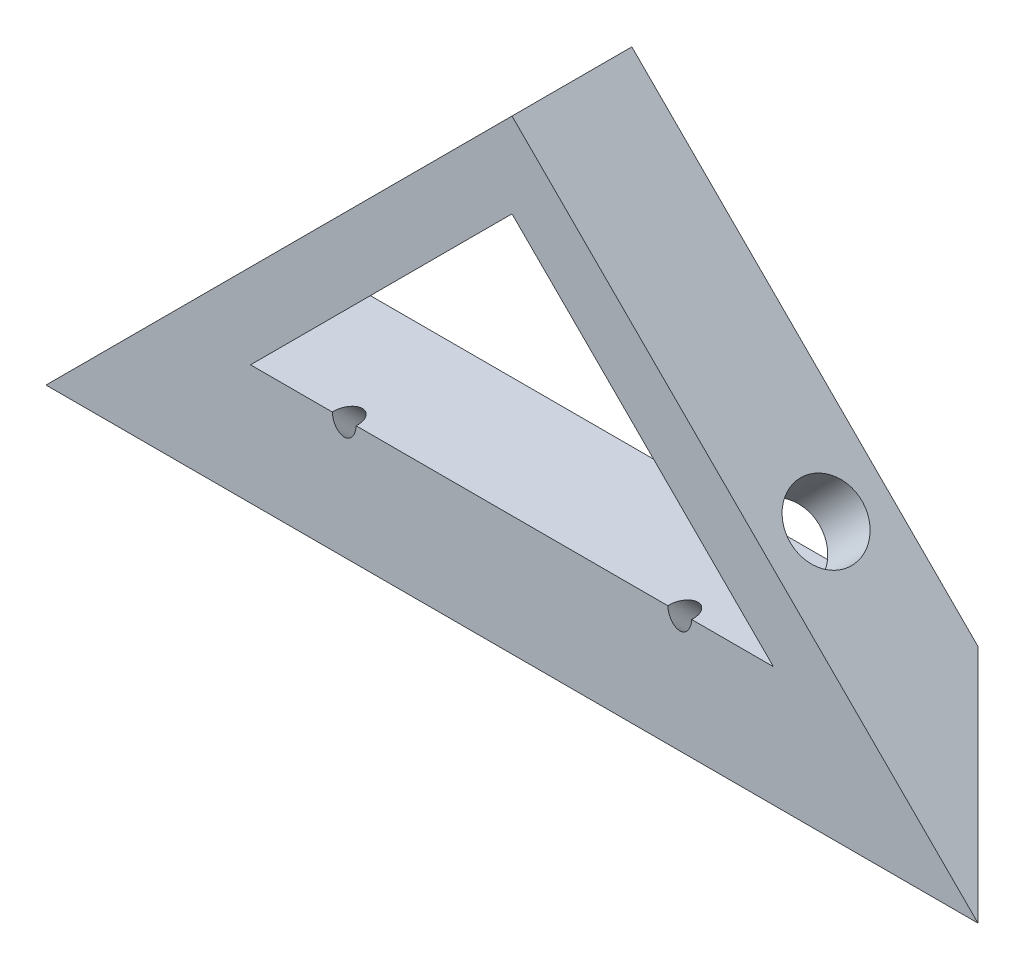
ISO-10303-21;
HEADER;
FILE_DESCRIPTION(('STEP AP214'),'2;1');
FILE_NAME('part.step','',(''),(''),'','','');
FILE_SCHEMA(('AUTOMOTIVE_DESIGN { 1 0 10303 214 1 1 1 1 }'));
ENDSEC;
DATA;
#1=APPLICATION_CONTEXT('core data for automotive mechanical design processes');
#2=APPLICATION_PROTOCOL_DEFINITION('international standard','automotive_design',2000,#1);
#3=PRODUCT_CONTEXT('',#1,'mechanical');
#4=PRODUCT('Part','Part','',(#3));
#5=PRODUCT_RELATED_PRODUCT_CATEGORY('part','',(#4));
#6=PRODUCT_DEFINITION_FORMATION('','',#4);
#7=PRODUCT_DEFINITION_CONTEXT('part definition',#1,'design');
#8=PRODUCT_DEFINITION('design','',#6,#7);
#9=PRODUCT_DEFINITION_SHAPE('','',#8);
#10=(LENGTH_UNIT() NAMED_UNIT(*) SI_UNIT(.MILLI.,.METRE.));
#11=(NAMED_UNIT(*) PLANE_ANGLE_UNIT() SI_UNIT($,.RADIAN.));
#12=(NAMED_UNIT(*) SI_UNIT($,.STERADIAN.) SOLID_ANGLE_UNIT());
#13=UNCERTAINTY_MEASURE_WITH_UNIT(LENGTH_MEASURE(1.E-05),#10,'distance_accuracy_value','');
#14=(GEOMETRIC_REPRESENTATION_CONTEXT(3) GLOBAL_UNCERTAINTY_ASSIGNED_CONTEXT((#13)) GLOBAL_UNIT_ASSIGNED_CONTEXT((#10,
#11,#12)) REPRESENTATION_CONTEXT('',''));
#15=CARTESIAN_POINT('',(0.,0.,0.));
#16=DIRECTION('',(0.,0.,1.));
#17=DIRECTION('',(1.,0.,0.));
#18=AXIS2_PLACEMENT_3D('',#15,#16,#17);
#19=CARTESIAN_POINT('',(14.4454364826299,14.4454364826297,10.));
#20=DIRECTION('',(-0.707106781186554,-0.707106781186541,0.));
#21=DIRECTION('',(0.707106781186541,-0.707106781186554,0.));
#22=AXIS2_PLACEMENT_3D('',#19,#20,#21);
#23=PLANE('',#22);
#24=CARTESIAN_POINT('',(21.2132034355962,7.67766952966327,5.));
#25=DIRECTION('',(0.707106781186554,0.707106781186541,0.));
#26=DIRECTION('',(-0.707106781186541,0.707106781186554,0.));
#27=AXIS2_PLACEMENT_3D('',#24,#25,#26);
#28=CIRCLE('',#27,3.);
#29=CARTESIAN_POINT('',(19.0918830920366,9.79898987322294,5.));
#30=VERTEX_POINT('',#29);
#31=EDGE_CURVE('E295',#30,#30,#28,.T.);
#32=ORIENTED_EDGE('',*,*,#31,.F.);
#33=EDGE_LOOP('',(#32));
#34=FACE_BOUND('',#33,.T.);
#35=DIRECTION('',(-0.707106781186541,0.707106781186554,0.));
#36=VECTOR('',#35,1.);
#37=CARTESIAN_POINT('',(14.4454364826299,14.4454364826297,10.));
#38=LINE('',#37,#36);
#39=CARTESIAN_POINT('',(38.8908729652592,-10.,10.));
#40=VERTEX_POINT('',#39);
#41=CARTESIAN_POINT('',(0.,28.8908729652599,10.));
#42=VERTEX_POINT('',#41);
#43=EDGE_CURVE('E127',#40,#42,#38,.T.);
#44=ORIENTED_EDGE('',*,*,#43,.F.);
#45=DIRECTION('',(-0.577350269189617,0.577350269189627,-0.577350269189633));
#46=VECTOR('',#45,1.);
#47=CARTESIAN_POINT('',(22.5939153101732,6.29695765508624,-6.29695765508641));
#48=LINE('',#47,#46);
#49=CARTESIAN_POINT('',(28.8908729652594,-1.05818132034585E-13,0.));
#50=VERTEX_POINT('',#49);
#51=EDGE_CURVE('E137',#40,#50,#48,.T.);
#52=ORIENTED_EDGE('',*,*,#51,.T.);
#53=DIRECTION('',(-0.707106781186541,0.707106781186554,0.));
#54=VECTOR('',#53,1.);
#55=CARTESIAN_POINT('',(14.4454364826299,14.4454364826297,0.));
#56=LINE('',#55,#54);
#57=CARTESIAN_POINT('',(0.,28.8908729652599,0.));
#58=VERTEX_POINT('',#57);
#59=EDGE_CURVE('E142',#50,#58,#56,.T.);
#60=ORIENTED_EDGE('',*,*,#59,.T.);
#61=DIRECTION('',(0.,0.,-1.));
#62=VECTOR('',#61,1.);
#63=CARTESIAN_POINT('',(0.,28.8908729652599,10.));
#64=LINE('',#63,#62);
#65=EDGE_CURVE('E147',#42,#58,#64,.T.);
#66=ORIENTED_EDGE('',*,*,#65,.F.);
#67=EDGE_LOOP('',(#44,#52,#60,#66));
#68=FACE_BOUND('',#67,.T.);
#69=ADVANCED_FACE('F33',(#34,#68),#23,.F.);
#70=CARTESIAN_POINT('',(10.9099025766972,10.909902576697,10.));
#71=DIRECTION('',(-0.707106781186554,-0.707106781186541,0.));
#72=DIRECTION('',(0.707106781186541,-0.707106781186554,0.));
#73=AXIS2_PLACEMENT_3D('',#70,#71,#72);
#74=PLANE('',#73);
#75=CARTESIAN_POINT('',(17.6776695296635,4.14213562373058,5.));
#76=DIRECTION('',(-0.707106781186554,-0.707106781186541,0.));
#77=DIRECTION('',(0.707106781186541,-0.707106781186554,0.));
#78=AXIS2_PLACEMENT_3D('',#75,#76,#77);
#79=CIRCLE('',#78,3.);
#80=CARTESIAN_POINT('',(19.7989898732231,2.02081528017091,5.));
#81=VERTEX_POINT('',#80);
#82=EDGE_CURVE('E109',#81,#81,#79,.F.);
#83=ORIENTED_EDGE('',*,*,#82,.T.);
#84=EDGE_LOOP('',(#83));
#85=FACE_BOUND('',#84,.T.);
#86=DIRECTION('',(-0.707106781186541,0.707106781186554,0.));
#87=VECTOR('',#86,1.);
#88=CARTESIAN_POINT('',(10.9099025766972,10.909902576697,0.));
#89=LINE('',#88,#87);
#90=CARTESIAN_POINT('',(21.819805153394,-1.05818132034585E-13,0.));
#91=VERTEX_POINT('',#90);
#92=CARTESIAN_POINT('',(0.,21.8198051533944,0.));
#93=VERTEX_POINT('',#92);
#94=EDGE_CURVE('E133',#91,#93,#89,.T.);
#95=ORIENTED_EDGE('',*,*,#94,.F.);
#96=DIRECTION('',(0.,0.,-1.));
#97=VECTOR('',#96,1.);
#98=CARTESIAN_POINT('',(21.8198051533939,0.,10.));
#99=LINE('',#98,#97);
#100=CARTESIAN_POINT('',(21.8198051533939,0.,10.));
#101=VERTEX_POINT('',#100);
#102=EDGE_CURVE('E150',#101,#91,#99,.T.);
#103=ORIENTED_EDGE('',*,*,#102,.F.);
#104=DIRECTION('',(-0.707106781186541,0.707106781186554,0.));
#105=VECTOR('',#104,1.);
#106=CARTESIAN_POINT('',(10.9099025766972,10.909902576697,10.));
#107=LINE('',#106,#105);
#108=CARTESIAN_POINT('',(0.,21.8198051533944,10.));
#109=VERTEX_POINT('',#108);
#110=EDGE_CURVE('E118',#101,#109,#107,.T.);
#111=ORIENTED_EDGE('',*,*,#110,.T.);
#112=DIRECTION('',(0.,0.,-1.));
#113=VECTOR('',#112,1.);
#114=CARTESIAN_POINT('',(0.,21.8198051533944,10.));
#115=LINE('',#114,#113);
#116=EDGE_CURVE('E132',#109,#93,#115,.T.);
#117=ORIENTED_EDGE('',*,*,#116,.T.);
#118=EDGE_LOOP('',(#95,#103,#111,#117));
#119=FACE_BOUND('',#118,.T.);
#120=ADVANCED_FACE('F35',(#85,#119),#74,.T.);
#121=CARTESIAN_POINT('',(0.,0.,10.));
#122=DIRECTION('',(0.,1.,0.));
#123=DIRECTION('',(-1.,0.,0.));
#124=AXIS2_PLACEMENT_3D('',#121,#122,#123);
#125=PLANE('',#124);
#126=CARTESIAN_POINT('',(-14.,0.,9.89949493661161));
#127=DIRECTION('',(0.,1.,0.));
#128=DIRECTION('',(0.,0.,-1.));
#129=AXIS2_PLACEMENT_3D('',#126,#127,#128);
#130=ELLIPSE('',#129,1.41421356237309,1.);
#131=CARTESIAN_POINT('',(-14.9974714863677,0.,10.));
#132=VERTEX_POINT('',#131);
#133=CARTESIAN_POINT('',(-13.0025285136323,0.,10.));
#134=VERTEX_POINT('',#133);
#135=EDGE_CURVE('E54',#132,#134,#130,.F.);
#136=ORIENTED_EDGE('',*,*,#135,.T.);
#137=DIRECTION('',(1.,0.,0.));
#138=VECTOR('',#137,1.);
#139=CARTESIAN_POINT('',(0.,0.,10.));
#140=LINE('',#139,#138);
#141=CARTESIAN_POINT('',(13.0025285136323,0.,10.));
#142=VERTEX_POINT('',#141);
#143=EDGE_CURVE('E107',#134,#142,#140,.T.);
#144=ORIENTED_EDGE('',*,*,#143,.T.);
#145=CARTESIAN_POINT('',(14.,0.,9.89949493661163));
#146=DIRECTION('',(0.,1.,0.));
#147=DIRECTION('',(0.,0.,-1.));
#148=AXIS2_PLACEMENT_3D('',#145,#146,#147);
#149=ELLIPSE('',#148,1.41421356237309,1.);
#150=CARTESIAN_POINT('',(14.9974714863677,0.,10.));
#151=VERTEX_POINT('',#150);
#152=EDGE_CURVE('E47',#142,#151,#149,.F.);
#153=ORIENTED_EDGE('',*,*,#152,.T.);
#154=EDGE_CURVE('E115',#151,#101,#140,.T.);
#155=ORIENTED_EDGE('',*,*,#154,.T.);
#156=ORIENTED_EDGE('',*,*,#102,.T.);
#157=DIRECTION('',(1.,0.,0.));
#158=VECTOR('',#157,1.);
#159=CARTESIAN_POINT('',(0.,0.,0.));
#160=LINE('',#159,#158);
#161=CARTESIAN_POINT('',(-21.8198051533947,-1.05818132034585E-13,0.));
#162=VERTEX_POINT('',#161);
#163=EDGE_CURVE('E136',#162,#91,#160,.T.);
#164=ORIENTED_EDGE('',*,*,#163,.F.);
#165=DIRECTION('',(0.,0.,-1.));
#166=VECTOR('',#165,1.);
#167=CARTESIAN_POINT('',(-21.8198051533947,0.,10.));
#168=LINE('',#167,#166);
#169=CARTESIAN_POINT('',(-21.8198051533947,0.,10.));
#170=VERTEX_POINT('',#169);
#171=EDGE_CURVE('E152',#170,#162,#168,.T.);
#172=ORIENTED_EDGE('',*,*,#171,.F.);
#173=EDGE_CURVE('E108',#170,#132,#140,.T.);
#174=ORIENTED_EDGE('',*,*,#173,.T.);
#175=EDGE_LOOP('',(#136,#144,#153,#155,#156,#164,#172,#174));
#176=FACE_BOUND('',#175,.T.);
#177=ADVANCED_FACE('F106',(#176),#125,.T.);
#178=CARTESIAN_POINT('',(-10.9099025766972,10.9099025766973,10.));
#179=DIRECTION('',(0.707106781186544,-0.707106781186551,0.));
#180=DIRECTION('',(0.707106781186551,0.707106781186544,0.));
#181=AXIS2_PLACEMENT_3D('',#178,#179,#180);
#182=PLANE('',#181);
#183=CARTESIAN_POINT('',(-17.6776695296638,4.14213562373082,5.));
#184=DIRECTION('',(0.707106781186544,-0.707106781186551,0.));
#185=DIRECTION('',(0.707106781186551,0.707106781186544,0.));
#186=AXIS2_PLACEMENT_3D('',#183,#184,#185);
#187=CIRCLE('',#186,3.);
#188=CARTESIAN_POINT('',(-15.5563491861042,6.26345596729045,5.));
#189=VERTEX_POINT('',#188);
#190=EDGE_CURVE('E298',#189,#189,#187,.F.);
#191=ORIENTED_EDGE('',*,*,#190,.T.);
#192=EDGE_LOOP('',(#191));
#193=FACE_BOUND('',#192,.T.);
#194=DIRECTION('',(-0.707106781186551,-0.707106781186544,0.));
#195=VECTOR('',#194,1.);
#196=CARTESIAN_POINT('',(-10.9099025766972,10.9099025766973,0.));
#197=LINE('',#196,#195);
#198=EDGE_CURVE('E139',#93,#162,#197,.T.);
#199=ORIENTED_EDGE('',*,*,#198,.F.);
#200=ORIENTED_EDGE('',*,*,#116,.F.);
#201=DIRECTION('',(-0.707106781186551,-0.707106781186544,0.));
#202=VECTOR('',#201,1.);
#203=CARTESIAN_POINT('',(-10.9099025766972,10.9099025766973,10.));
#204=LINE('',#203,#202);
#205=EDGE_CURVE('E117',#109,#170,#204,.T.);
#206=ORIENTED_EDGE('',*,*,#205,.T.);
#207=ORIENTED_EDGE('',*,*,#171,.T.);
#208=EDGE_LOOP('',(#199,#200,#206,#207));
#209=FACE_BOUND('',#208,.T.);
#210=ADVANCED_FACE('F167',(#193,#209),#182,.T.);
#211=CARTESIAN_POINT('',(-14.4454364826299,14.4454364826301,10.));
#212=DIRECTION('',(0.707106781186544,-0.707106781186551,0.));
#213=DIRECTION('',(0.707106781186551,0.707106781186544,0.));
#214=AXIS2_PLACEMENT_3D('',#211,#212,#213);
#215=PLANE('',#214);
#216=CARTESIAN_POINT('',(-21.2132034355966,7.67766952966359,5.));
#217=DIRECTION('',(-0.707106781186544,0.707106781186551,0.));
#218=DIRECTION('',(-0.707106781186551,-0.707106781186544,0.));
#219=AXIS2_PLACEMENT_3D('',#216,#217,#218);
#220=CIRCLE('',#219,3.);
#221=CARTESIAN_POINT('',(-23.3345237791562,5.55634918610396,5.));
#222=VERTEX_POINT('',#221);
#223=EDGE_CURVE('E300',#222,#222,#220,.T.);
#224=ORIENTED_EDGE('',*,*,#223,.F.);
#225=EDGE_LOOP('',(#224));
#226=FACE_BOUND('',#225,.T.);
#227=DIRECTION('',(-0.707106781186551,-0.707106781186544,0.));
#228=VECTOR('',#227,1.);
#229=CARTESIAN_POINT('',(-14.4454364826299,14.4454364826301,0.));
#230=LINE('',#229,#228);
#231=CARTESIAN_POINT('',(-28.8908729652602,0.,0.));
#232=VERTEX_POINT('',#231);
#233=EDGE_CURVE('E144',#58,#232,#230,.T.);
#234=ORIENTED_EDGE('',*,*,#233,.T.);
#235=DIRECTION('',(-0.577350269189628,-0.577350269189622,0.577350269189628));
#236=VECTOR('',#235,1.);
#237=CARTESIAN_POINT('',(-22.5939153101735,6.29695765508669,-6.29695765508685));
#238=LINE('',#237,#236);
#239=CARTESIAN_POINT('',(-38.8908729652603,-10.,10.));
#240=VERTEX_POINT('',#239);
#241=EDGE_CURVE('E303',#232,#240,#238,.T.);
#242=ORIENTED_EDGE('',*,*,#241,.T.);
#243=DIRECTION('',(-0.707106781186551,-0.707106781186544,0.));
#244=VECTOR('',#243,1.);
#245=CARTESIAN_POINT('',(-14.4454364826299,14.4454364826301,10.));
#246=LINE('',#245,#244);
#247=EDGE_CURVE('E129',#42,#240,#246,.T.);
#248=ORIENTED_EDGE('',*,*,#247,.F.);
#249=ORIENTED_EDGE('',*,*,#65,.T.);
#250=EDGE_LOOP('',(#234,#242,#248,#249));
#251=FACE_BOUND('',#250,.T.);
#252=ADVANCED_FACE('F170',(#226,#251),#215,.F.);
#253=CARTESIAN_POINT('',(0.,0.,10.));
#254=DIRECTION('',(0.,0.,1.));
#255=DIRECTION('',(1.,0.,0.));
#256=AXIS2_PLACEMENT_3D('',#253,#254,#255);
#257=PLANE('',#256);
#258=CARTESIAN_POINT('',(-14.,0.100505063388384,10.));
#259=DIRECTION('',(0.,0.,1.));
#260=DIRECTION('',(0.,-1.,0.));
#261=AXIS2_PLACEMENT_3D('',#258,#259,#260);
#262=ELLIPSE('',#261,1.4142135623731,1.);
#263=EDGE_CURVE('E95',#134,#132,#262,.F.);
#264=ORIENTED_EDGE('',*,*,#263,.T.);
#265=ORIENTED_EDGE('',*,*,#173,.F.);
#266=ORIENTED_EDGE('',*,*,#205,.F.);
#267=ORIENTED_EDGE('',*,*,#110,.F.);
#268=ORIENTED_EDGE('',*,*,#154,.F.);
#269=CARTESIAN_POINT('',(14.,0.100505063388384,10.));
#270=DIRECTION('',(0.,0.,1.));
#271=DIRECTION('',(0.,-1.,0.));
#272=AXIS2_PLACEMENT_3D('',#269,#270,#271);
#273=ELLIPSE('',#272,1.4142135623731,1.);
#274=EDGE_CURVE('E114',#151,#142,#273,.F.);
#275=ORIENTED_EDGE('',*,*,#274,.T.);
#276=ORIENTED_EDGE('',*,*,#143,.F.);
#277=EDGE_LOOP('',(#264,#265,#266,#267,#268,#275,#276));
#278=FACE_BOUND('',#277,.T.);
#279=DIRECTION('',(1.,0.,0.));
#280=VECTOR('',#279,1.);
#281=CARTESIAN_POINT('',(0.,-10.,10.));
#282=LINE('',#281,#280);
#283=EDGE_CURVE('E124',#240,#40,#282,.T.);
#284=ORIENTED_EDGE('',*,*,#283,.T.);
#285=ORIENTED_EDGE('',*,*,#43,.T.);
#286=ORIENTED_EDGE('',*,*,#247,.T.);
#287=EDGE_LOOP('',(#284,#285,#286));
#288=FACE_BOUND('',#287,.T.);
#289=ADVANCED_FACE('F111',(#278,#288),#257,.T.);
#290=CARTESIAN_POINT('',(0.,0.,0.));
#291=DIRECTION('',(0.,0.,1.));
#292=DIRECTION('',(1.,0.,0.));
#293=AXIS2_PLACEMENT_3D('',#290,#291,#292);
#294=PLANE('',#293);
#295=ORIENTED_EDGE('',*,*,#59,.F.);
#296=DIRECTION('',(-1.,0.,0.));
#297=VECTOR('',#296,1.);
#298=CARTESIAN_POINT('',(0.,0.,0.));
#299=LINE('',#298,#297);
#300=EDGE_CURVE('E11',#50,#91,#299,.T.);
#301=ORIENTED_EDGE('',*,*,#300,.T.);
#302=ORIENTED_EDGE('',*,*,#94,.T.);
#303=ORIENTED_EDGE('',*,*,#198,.T.);
#304=EDGE_CURVE('E37',#162,#232,#299,.T.);
#305=ORIENTED_EDGE('',*,*,#304,.T.);
#306=ORIENTED_EDGE('',*,*,#233,.F.);
#307=EDGE_LOOP('',(#295,#301,#302,#303,#305,#306));
#308=FACE_BOUND('',#307,.T.);
#309=ADVANCED_FACE('F164',(#308),#294,.F.);
#310=CARTESIAN_POINT('',(-38.8908729652603,-10.,10.));
#311=DIRECTION('',(0.,0.707106781186551,0.707106781186544));
#312=DIRECTION('',(0.,-0.707106781186544,0.707106781186551));
#313=AXIS2_PLACEMENT_3D('',#310,#311,#312);
#314=PLANE('',#313);
#315=CARTESIAN_POINT('',(-14.,-4.94974746830581,4.94974746830586));
#316=DIRECTION('',(0.,-0.707106781186551,-0.707106781186544));
#317=DIRECTION('',(0.,0.707106781186544,-0.707106781186551));
#318=AXIS2_PLACEMENT_3D('',#315,#316,#317);
#319=CIRCLE('',#318,1.);
#320=CARTESIAN_POINT('',(-14.,-4.24264068711926,4.24264068711931));
#321=VERTEX_POINT('',#320);
#322=EDGE_CURVE('E102',#321,#321,#319,.T.);
#323=ORIENTED_EDGE('',*,*,#322,.F.);
#324=EDGE_LOOP('',(#323));
#325=FACE_BOUND('',#324,.T.);
#326=CARTESIAN_POINT('',(14.,-4.94974746830581,4.94974746830586));
#327=DIRECTION('',(0.,-0.707106781186551,-0.707106781186544));
#328=DIRECTION('',(0.,-0.707106781186544,0.707106781186551));
#329=AXIS2_PLACEMENT_3D('',#326,#327,#328);
#330=CIRCLE('',#329,1.);
#331=CARTESIAN_POINT('',(14.,-5.65685424949235,5.65685424949241));
#332=VERTEX_POINT('',#331);
#333=EDGE_CURVE('E287',#332,#332,#330,.T.);
#334=ORIENTED_EDGE('',*,*,#333,.F.);
#335=EDGE_LOOP('',(#334));
#336=FACE_BOUND('',#335,.T.);
#337=ORIENTED_EDGE('',*,*,#283,.F.);
#338=ORIENTED_EDGE('',*,*,#241,.F.);
#339=ORIENTED_EDGE('',*,*,#304,.F.);
#340=ORIENTED_EDGE('',*,*,#163,.T.);
#341=ORIENTED_EDGE('',*,*,#300,.F.);
#342=ORIENTED_EDGE('',*,*,#51,.F.);
#343=EDGE_LOOP('',(#337,#338,#339,#340,#341,#342));
#344=FACE_BOUND('',#343,.T.);
#345=ADVANCED_FACE('F193',(#325,#336,#344),#314,.F.);
#346=CARTESIAN_POINT('',(17.6786695296628,-31.2142034355962,5.));
#347=DIRECTION('',(-0.707106781186544,0.707106781186551,0.));
#348=DIRECTION('',(-0.707106781186551,-0.707106781186544,0.));
#349=AXIS2_PLACEMENT_3D('',#346,#347,#348);
#350=CYLINDRICAL_SURFACE('',#349,3.);
#351=ORIENTED_EDGE('',*,*,#190,.F.);
#352=EDGE_LOOP('',(#351));
#353=FACE_BOUND('',#352,.T.);
#354=ORIENTED_EDGE('',*,*,#223,.T.);
#355=EDGE_LOOP('',(#354));
#356=FACE_BOUND('',#355,.T.);
#357=ADVANCED_FACE('F198',(#353,#356),#350,.F.);
#358=CARTESIAN_POINT('',(-17.6786695296642,-31.2142034355965,5.));
#359=DIRECTION('',(0.707106781186554,0.707106781186541,0.));
#360=DIRECTION('',(-0.707106781186541,0.707106781186554,0.));
#361=AXIS2_PLACEMENT_3D('',#358,#359,#360);
#362=CYLINDRICAL_SURFACE('',#361,3.);
#363=ORIENTED_EDGE('',*,*,#82,.F.);
#364=EDGE_LOOP('',(#363));
#365=FACE_BOUND('',#364,.T.);
#366=ORIENTED_EDGE('',*,*,#31,.T.);
#367=EDGE_LOOP('',(#366));
#368=FACE_BOUND('',#367,.T.);
#369=ADVANCED_FACE('F202',(#365,#368),#362,.F.);
#370=CARTESIAN_POINT('',(14.,14.4966890143243,24.3961839509358));
#371=DIRECTION('',(0.,-0.707106781186551,-0.707106781186544));
#372=DIRECTION('',(0.,0.707106781186544,-0.707106781186551));
#373=AXIS2_PLACEMENT_3D('',#370,#371,#372);
#374=CYLINDRICAL_SURFACE('',#373,1.);
#375=ORIENTED_EDGE('',*,*,#274,.F.);
#376=ORIENTED_EDGE('',*,*,#152,.F.);
#377=EDGE_LOOP('',(#375,#376));
#378=FACE_BOUND('',#377,.T.);
#379=ORIENTED_EDGE('',*,*,#333,.T.);
#380=EDGE_LOOP('',(#379));
#381=FACE_BOUND('',#380,.T.);
#382=ADVANCED_FACE('F206',(#378,#381),#374,.F.);
#383=CARTESIAN_POINT('',(-14.,14.4966890143243,24.3961839509358));
#384=DIRECTION('',(0.,-0.707106781186551,-0.707106781186544));
#385=DIRECTION('',(0.,0.707106781186544,-0.707106781186551));
#386=AXIS2_PLACEMENT_3D('',#383,#384,#385);
#387=CYLINDRICAL_SURFACE('',#386,1.);
#388=ORIENTED_EDGE('',*,*,#263,.F.);
#389=ORIENTED_EDGE('',*,*,#135,.F.);
#390=EDGE_LOOP('',(#388,#389));
#391=FACE_BOUND('',#390,.T.);
#392=ORIENTED_EDGE('',*,*,#322,.T.);
#393=EDGE_LOOP('',(#392));
#394=FACE_BOUND('',#393,.T.);
#395=ADVANCED_FACE('F96',(#391,#394),#387,.F.);
#396=CLOSED_SHELL('',(#69,#120,#177,#210,#252,#289,#309,#345,#357,#369,#382,#395));
#397=MANIFOLD_SOLID_BREP('B2',#396);
#398=ADVANCED_BREP_SHAPE_REPRESENTATION('',(#18,#397),#14);
#399=SHAPE_DEFINITION_REPRESENTATION(#9,#398);
ENDSEC;
END-ISO-10303-21;
